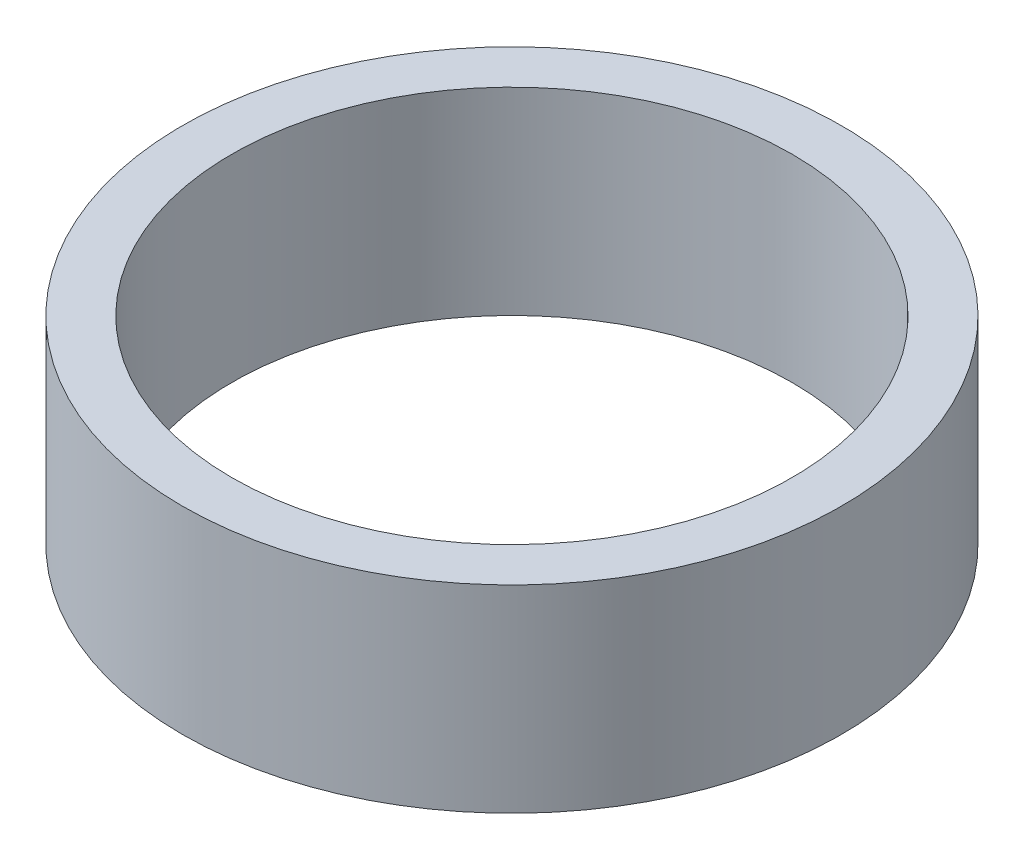
ISO-10303-21;
HEADER;
FILE_DESCRIPTION(('STEP AP214'),'2;1');
FILE_NAME('part.step','',(''),(''),'','','');
FILE_SCHEMA(('AUTOMOTIVE_DESIGN { 1 0 10303 214 1 1 1 1 }'));
ENDSEC;
DATA;
#1=APPLICATION_CONTEXT('core data for automotive mechanical design processes');
#2=APPLICATION_PROTOCOL_DEFINITION('international standard','automotive_design',2000,#1);
#3=PRODUCT_CONTEXT('',#1,'mechanical');
#4=PRODUCT('Part','Part','',(#3));
#5=PRODUCT_RELATED_PRODUCT_CATEGORY('part','',(#4));
#6=PRODUCT_DEFINITION_FORMATION('','',#4);
#7=PRODUCT_DEFINITION_CONTEXT('part definition',#1,'design');
#8=PRODUCT_DEFINITION('design','',#6,#7);
#9=PRODUCT_DEFINITION_SHAPE('','',#8);
#10=(LENGTH_UNIT() NAMED_UNIT(*) SI_UNIT(.MILLI.,.METRE.));
#11=(NAMED_UNIT(*) PLANE_ANGLE_UNIT() SI_UNIT($,.RADIAN.));
#12=(NAMED_UNIT(*) SI_UNIT($,.STERADIAN.) SOLID_ANGLE_UNIT());
#13=UNCERTAINTY_MEASURE_WITH_UNIT(LENGTH_MEASURE(1.E-05),#10,'distance_accuracy_value','');
#14=(GEOMETRIC_REPRESENTATION_CONTEXT(3) GLOBAL_UNCERTAINTY_ASSIGNED_CONTEXT((#13)) GLOBAL_UNIT_ASSIGNED_CONTEXT((#10,
#11,#12)) REPRESENTATION_CONTEXT('',''));
#15=CARTESIAN_POINT('',(0.,0.,0.));
#16=DIRECTION('',(0.,0.,1.));
#17=DIRECTION('',(1.,0.,0.));
#18=AXIS2_PLACEMENT_3D('',#15,#16,#17);
#19=CARTESIAN_POINT('',(0.,30.,0.));
#20=DIRECTION('',(0.,-1.,0.));
#21=DIRECTION('',(0.,0.,-1.));
#22=AXIS2_PLACEMENT_3D('',#19,#20,#21);
#23=CYLINDRICAL_SURFACE('',#22,50.);
#24=CARTESIAN_POINT('',(0.,30.,0.));
#25=DIRECTION('',(0.,1.,0.));
#26=DIRECTION('',(0.,0.,1.));
#27=AXIS2_PLACEMENT_3D('',#24,#25,#26);
#28=CIRCLE('',#27,50.);
#29=CARTESIAN_POINT('',(0.,30.,50.));
#30=VERTEX_POINT('',#29);
#31=EDGE_CURVE('E10',#30,#30,#28,.T.);
#32=ORIENTED_EDGE('',*,*,#31,.F.);
#33=EDGE_LOOP('',(#32));
#34=FACE_BOUND('',#33,.T.);
#35=CARTESIAN_POINT('',(0.,0.,0.));
#36=DIRECTION('',(0.,1.,0.));
#37=DIRECTION('',(0.,0.,1.));
#38=AXIS2_PLACEMENT_3D('',#35,#36,#37);
#39=CIRCLE('',#38,50.);
#40=CARTESIAN_POINT('',(0.,0.,50.));
#41=VERTEX_POINT('',#40);
#42=EDGE_CURVE('E37',#41,#41,#39,.T.);
#43=ORIENTED_EDGE('',*,*,#42,.T.);
#44=EDGE_LOOP('',(#43));
#45=FACE_BOUND('',#44,.T.);
#46=ADVANCED_FACE('F40',(#34,#45),#23,.T.);
#47=CARTESIAN_POINT('',(0.,30.,0.));
#48=DIRECTION('',(0.,1.,0.));
#49=DIRECTION('',(0.,0.,1.));
#50=AXIS2_PLACEMENT_3D('',#47,#48,#49);
#51=PLANE('',#50);
#52=CARTESIAN_POINT('',(0.,30.,0.));
#53=DIRECTION('',(0.,1.,0.));
#54=DIRECTION('',(0.,0.,1.));
#55=AXIS2_PLACEMENT_3D('',#52,#53,#54);
#56=CIRCLE('',#55,42.5);
#57=CARTESIAN_POINT('',(0.,30.,42.5));
#58=VERTEX_POINT('',#57);
#59=EDGE_CURVE('E50',#58,#58,#56,.T.);
#60=ORIENTED_EDGE('',*,*,#59,.F.);
#61=EDGE_LOOP('',(#60));
#62=FACE_BOUND('',#61,.T.);
#63=ORIENTED_EDGE('',*,*,#31,.T.);
#64=EDGE_LOOP('',(#63));
#65=FACE_BOUND('',#64,.T.);
#66=ADVANCED_FACE('F59',(#62,#65),#51,.T.);
#67=CARTESIAN_POINT('',(0.,0.,0.));
#68=DIRECTION('',(0.,1.,0.));
#69=DIRECTION('',(0.,0.,1.));
#70=AXIS2_PLACEMENT_3D('',#67,#68,#69);
#71=PLANE('',#70);
#72=CARTESIAN_POINT('',(0.,0.,0.));
#73=DIRECTION('',(0.,1.,0.));
#74=DIRECTION('',(0.,0.,1.));
#75=AXIS2_PLACEMENT_3D('',#72,#73,#74);
#76=CIRCLE('',#75,42.5);
#77=CARTESIAN_POINT('',(0.,0.,42.5));
#78=VERTEX_POINT('',#77);
#79=EDGE_CURVE('E47',#78,#78,#76,.T.);
#80=ORIENTED_EDGE('',*,*,#79,.T.);
#81=EDGE_LOOP('',(#80));
#82=FACE_BOUND('',#81,.T.);
#83=ORIENTED_EDGE('',*,*,#42,.F.);
#84=EDGE_LOOP('',(#83));
#85=FACE_BOUND('',#84,.T.);
#86=ADVANCED_FACE('F58',(#82,#85),#71,.F.);
#87=CARTESIAN_POINT('',(0.,30.,0.));
#88=DIRECTION('',(0.,-1.,0.));
#89=DIRECTION('',(0.,0.,-1.));
#90=AXIS2_PLACEMENT_3D('',#87,#88,#89);
#91=CYLINDRICAL_SURFACE('',#90,42.5);
#92=ORIENTED_EDGE('',*,*,#59,.T.);
#93=EDGE_LOOP('',(#92));
#94=FACE_BOUND('',#93,.T.);
#95=ORIENTED_EDGE('',*,*,#79,.F.);
#96=EDGE_LOOP('',(#95));
#97=FACE_BOUND('',#96,.T.);
#98=ADVANCED_FACE('F54',(#94,#97),#91,.F.);
#99=CLOSED_SHELL('',(#46,#66,#86,#98));
#100=MANIFOLD_SOLID_BREP('B2',#99);
#101=ADVANCED_BREP_SHAPE_REPRESENTATION('',(#18,#100),#14);
#102=SHAPE_DEFINITION_REPRESENTATION(#9,#101);
ENDSEC;
END-ISO-10303-21;
